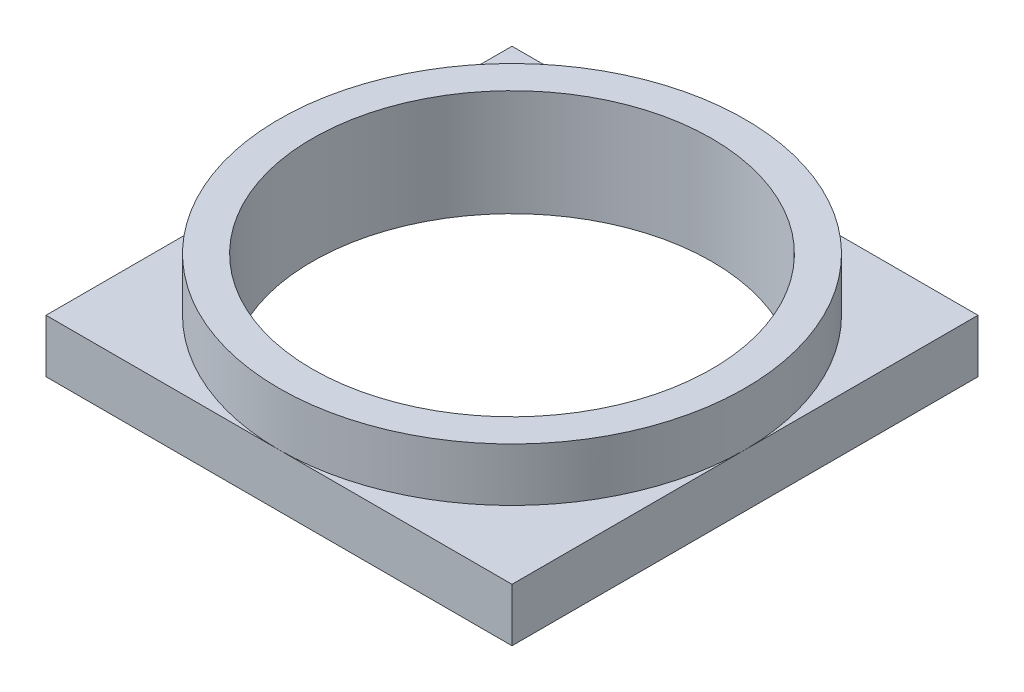
ISO-10303-21;
HEADER;
FILE_DESCRIPTION(('STEP AP214'),'2;1');
FILE_NAME('part.step','',(''),(''),'','','');
FILE_SCHEMA(('AUTOMOTIVE_DESIGN { 1 0 10303 214 1 1 1 1 }'));
ENDSEC;
DATA;
#1=APPLICATION_CONTEXT('core data for automotive mechanical design processes');
#2=APPLICATION_PROTOCOL_DEFINITION('international standard','automotive_design',2000,#1);
#3=PRODUCT_CONTEXT('',#1,'mechanical');
#4=PRODUCT('Part','Part','',(#3));
#5=PRODUCT_RELATED_PRODUCT_CATEGORY('part','',(#4));
#6=PRODUCT_DEFINITION_FORMATION('','',#4);
#7=PRODUCT_DEFINITION_CONTEXT('part definition',#1,'design');
#8=PRODUCT_DEFINITION('design','',#6,#7);
#9=PRODUCT_DEFINITION_SHAPE('','',#8);
#10=(LENGTH_UNIT() NAMED_UNIT(*) SI_UNIT(.MILLI.,.METRE.));
#11=(NAMED_UNIT(*) PLANE_ANGLE_UNIT() SI_UNIT($,.RADIAN.));
#12=(NAMED_UNIT(*) SI_UNIT($,.STERADIAN.) SOLID_ANGLE_UNIT());
#13=UNCERTAINTY_MEASURE_WITH_UNIT(LENGTH_MEASURE(1.E-05),#10,'distance_accuracy_value','');
#14=(GEOMETRIC_REPRESENTATION_CONTEXT(3) GLOBAL_UNCERTAINTY_ASSIGNED_CONTEXT((#13)) GLOBAL_UNIT_ASSIGNED_CONTEXT((#10,
#11,#12)) REPRESENTATION_CONTEXT('',''));
#15=CARTESIAN_POINT('',(0.,0.,0.));
#16=DIRECTION('',(0.,0.,1.));
#17=DIRECTION('',(1.,0.,0.));
#18=AXIS2_PLACEMENT_3D('',#15,#16,#17);
#19=CARTESIAN_POINT('',(0.,1.6,0.));
#20=DIRECTION('',(0.,-1.,0.));
#21=DIRECTION('',(0.,0.,-1.));
#22=AXIS2_PLACEMENT_3D('',#19,#20,#21);
#23=PLANE('',#22);
#24=CARTESIAN_POINT('',(0.,1.6,0.));
#25=DIRECTION('',(0.,1.,0.));
#26=DIRECTION('',(0.,0.,1.));
#27=AXIS2_PLACEMENT_3D('',#24,#25,#26);
#28=CIRCLE('',#27,7.);
#29=CARTESIAN_POINT('',(0.,1.6,7.));
#30=VERTEX_POINT('',#29);
#31=CARTESIAN_POINT('',(7.,1.6,0.));
#32=VERTEX_POINT('',#31);
#33=EDGE_CURVE('E44',#30,#32,#28,.T.);
#34=ORIENTED_EDGE('',*,*,#33,.F.);
#35=DIRECTION('',(1.,0.,0.));
#36=VECTOR('',#35,1.);
#37=CARTESIAN_POINT('',(-7.,1.6,7.));
#38=LINE('',#37,#36);
#39=CARTESIAN_POINT('',(7.,1.6,7.));
#40=VERTEX_POINT('',#39);
#41=EDGE_CURVE('E95',#30,#40,#38,.T.);
#42=ORIENTED_EDGE('',*,*,#41,.T.);
#43=DIRECTION('',(0.,0.,-1.));
#44=VECTOR('',#43,1.);
#45=CARTESIAN_POINT('',(7.,1.6,7.));
#46=LINE('',#45,#44);
#47=EDGE_CURVE('E106',#40,#32,#46,.T.);
#48=ORIENTED_EDGE('',*,*,#47,.T.);
#49=EDGE_LOOP('',(#34,#42,#48));
#50=FACE_BOUND('',#49,.T.);
#51=ADVANCED_FACE('F33',(#50),#23,.F.);
#52=CARTESIAN_POINT('',(0.,1.6,-7.));
#53=VERTEX_POINT('',#52);
#54=EDGE_CURVE('E11',#32,#53,#28,.T.);
#55=ORIENTED_EDGE('',*,*,#54,.F.);
#56=CARTESIAN_POINT('',(7.,1.6,-7.));
#57=VERTEX_POINT('',#56);
#58=EDGE_CURVE('E118',#32,#57,#46,.T.);
#59=ORIENTED_EDGE('',*,*,#58,.T.);
#60=DIRECTION('',(-1.,0.,0.));
#61=VECTOR('',#60,1.);
#62=CARTESIAN_POINT('',(-7.,1.6,-7.));
#63=LINE('',#62,#61);
#64=EDGE_CURVE('E119',#57,#53,#63,.T.);
#65=ORIENTED_EDGE('',*,*,#64,.T.);
#66=EDGE_LOOP('',(#55,#59,#65));
#67=FACE_BOUND('',#66,.T.);
#68=ADVANCED_FACE('F150',(#67),#23,.F.);
#69=CARTESIAN_POINT('',(-7.,1.6,0.));
#70=VERTEX_POINT('',#69);
#71=EDGE_CURVE('E42',#53,#70,#28,.T.);
#72=ORIENTED_EDGE('',*,*,#71,.F.);
#73=CARTESIAN_POINT('',(-7.,1.6,-7.));
#74=VERTEX_POINT('',#73);
#75=EDGE_CURVE('E117',#53,#74,#63,.T.);
#76=ORIENTED_EDGE('',*,*,#75,.T.);
#77=DIRECTION('',(0.,0.,1.));
#78=VECTOR('',#77,1.);
#79=CARTESIAN_POINT('',(-7.,1.6,7.));
#80=LINE('',#79,#78);
#81=EDGE_CURVE('E104',#74,#70,#80,.T.);
#82=ORIENTED_EDGE('',*,*,#81,.T.);
#83=EDGE_LOOP('',(#72,#76,#82));
#84=FACE_BOUND('',#83,.T.);
#85=ADVANCED_FACE('F152',(#84),#23,.F.);
#86=CARTESIAN_POINT('',(7.,1.6,7.));
#87=DIRECTION('',(-1.,0.,0.));
#88=DIRECTION('',(0.,0.,1.));
#89=AXIS2_PLACEMENT_3D('',#86,#87,#88);
#90=PLANE('',#89);
#91=DIRECTION('',(0.,0.,-1.));
#92=VECTOR('',#91,1.);
#93=CARTESIAN_POINT('',(7.,0.,7.));
#94=LINE('',#93,#92);
#95=CARTESIAN_POINT('',(7.,0.,7.));
#96=VERTEX_POINT('',#95);
#97=CARTESIAN_POINT('',(7.,0.,-7.));
#98=VERTEX_POINT('',#97);
#99=EDGE_CURVE('E123',#96,#98,#94,.T.);
#100=ORIENTED_EDGE('',*,*,#99,.T.);
#101=DIRECTION('',(0.,-1.,0.));
#102=VECTOR('',#101,1.);
#103=CARTESIAN_POINT('',(7.,1.6,-7.));
#104=LINE('',#103,#102);
#105=EDGE_CURVE('E37',#57,#98,#104,.T.);
#106=ORIENTED_EDGE('',*,*,#105,.F.);
#107=ORIENTED_EDGE('',*,*,#58,.F.);
#108=ORIENTED_EDGE('',*,*,#47,.F.);
#109=DIRECTION('',(0.,-1.,0.));
#110=VECTOR('',#109,1.);
#111=CARTESIAN_POINT('',(7.,1.6,7.));
#112=LINE('',#111,#110);
#113=EDGE_CURVE('E94',#40,#96,#112,.T.);
#114=ORIENTED_EDGE('',*,*,#113,.T.);
#115=EDGE_LOOP('',(#100,#106,#107,#108,#114));
#116=FACE_BOUND('',#115,.T.);
#117=ADVANCED_FACE('F35',(#116),#90,.F.);
#118=CARTESIAN_POINT('',(-7.,1.6,-7.));
#119=DIRECTION('',(0.,0.,1.));
#120=DIRECTION('',(1.,0.,0.));
#121=AXIS2_PLACEMENT_3D('',#118,#119,#120);
#122=PLANE('',#121);
#123=DIRECTION('',(-1.,0.,0.));
#124=VECTOR('',#123,1.);
#125=CARTESIAN_POINT('',(-7.,0.,-7.));
#126=LINE('',#125,#124);
#127=CARTESIAN_POINT('',(-7.,0.,-7.));
#128=VERTEX_POINT('',#127);
#129=EDGE_CURVE('E126',#98,#128,#126,.T.);
#130=ORIENTED_EDGE('',*,*,#129,.T.);
#131=DIRECTION('',(0.,-1.,0.));
#132=VECTOR('',#131,1.);
#133=CARTESIAN_POINT('',(-7.,1.6,-7.));
#134=LINE('',#133,#132);
#135=EDGE_CURVE('E112',#74,#128,#134,.T.);
#136=ORIENTED_EDGE('',*,*,#135,.F.);
#137=ORIENTED_EDGE('',*,*,#75,.F.);
#138=ORIENTED_EDGE('',*,*,#64,.F.);
#139=ORIENTED_EDGE('',*,*,#105,.T.);
#140=EDGE_LOOP('',(#130,#136,#137,#138,#139));
#141=FACE_BOUND('',#140,.T.);
#142=ADVANCED_FACE('F151',(#141),#122,.F.);
#143=CARTESIAN_POINT('',(-7.,1.6,7.));
#144=DIRECTION('',(1.,0.,0.));
#145=DIRECTION('',(0.,0.,-1.));
#146=AXIS2_PLACEMENT_3D('',#143,#144,#145);
#147=PLANE('',#146);
#148=DIRECTION('',(0.,0.,1.));
#149=VECTOR('',#148,1.);
#150=CARTESIAN_POINT('',(-7.,0.,7.));
#151=LINE('',#150,#149);
#152=CARTESIAN_POINT('',(-7.,0.,7.));
#153=VERTEX_POINT('',#152);
#154=EDGE_CURVE('E128',#128,#153,#151,.T.);
#155=ORIENTED_EDGE('',*,*,#154,.T.);
#156=DIRECTION('',(0.,-1.,0.));
#157=VECTOR('',#156,1.);
#158=CARTESIAN_POINT('',(-7.,1.6,7.));
#159=LINE('',#158,#157);
#160=CARTESIAN_POINT('',(-7.,1.6,7.));
#161=VERTEX_POINT('',#160);
#162=EDGE_CURVE('E133',#161,#153,#159,.T.);
#163=ORIENTED_EDGE('',*,*,#162,.F.);
#164=EDGE_CURVE('E90',#70,#161,#80,.T.);
#165=ORIENTED_EDGE('',*,*,#164,.F.);
#166=ORIENTED_EDGE('',*,*,#81,.F.);
#167=ORIENTED_EDGE('',*,*,#135,.T.);
#168=EDGE_LOOP('',(#155,#163,#165,#166,#167));
#169=FACE_BOUND('',#168,.T.);
#170=ADVANCED_FACE('F139',(#169),#147,.F.);
#171=CARTESIAN_POINT('',(-7.,1.6,7.));
#172=DIRECTION('',(0.,0.,-1.));
#173=DIRECTION('',(-1.,0.,0.));
#174=AXIS2_PLACEMENT_3D('',#171,#172,#173);
#175=PLANE('',#174);
#176=DIRECTION('',(1.,0.,0.));
#177=VECTOR('',#176,1.);
#178=CARTESIAN_POINT('',(-7.,0.,7.));
#179=LINE('',#178,#177);
#180=EDGE_CURVE('E130',#153,#96,#179,.T.);
#181=ORIENTED_EDGE('',*,*,#180,.T.);
#182=ORIENTED_EDGE('',*,*,#113,.F.);
#183=ORIENTED_EDGE('',*,*,#41,.F.);
#184=EDGE_CURVE('E87',#161,#30,#38,.T.);
#185=ORIENTED_EDGE('',*,*,#184,.F.);
#186=ORIENTED_EDGE('',*,*,#162,.T.);
#187=EDGE_LOOP('',(#181,#182,#183,#185,#186));
#188=FACE_BOUND('',#187,.T.);
#189=ADVANCED_FACE('F99',(#188),#175,.F.);
#190=EDGE_CURVE('E51',#70,#30,#28,.T.);
#191=ORIENTED_EDGE('',*,*,#190,.F.);
#192=ORIENTED_EDGE('',*,*,#164,.T.);
#193=ORIENTED_EDGE('',*,*,#184,.T.);
#194=EDGE_LOOP('',(#191,#192,#193));
#195=FACE_BOUND('',#194,.T.);
#196=ADVANCED_FACE('F89',(#195),#23,.F.);
#197=CARTESIAN_POINT('',(0.,0.,0.));
#198=DIRECTION('',(0.,-1.,0.));
#199=DIRECTION('',(0.,0.,-1.));
#200=AXIS2_PLACEMENT_3D('',#197,#198,#199);
#201=PLANE('',#200);
#202=CARTESIAN_POINT('',(0.,0.,0.));
#203=DIRECTION('',(0.,1.,0.));
#204=DIRECTION('',(0.,0.,1.));
#205=AXIS2_PLACEMENT_3D('',#202,#203,#204);
#206=CIRCLE('',#205,6.);
#207=CARTESIAN_POINT('',(0.,0.,6.));
#208=VERTEX_POINT('',#207);
#209=EDGE_CURVE('E256',#208,#208,#206,.T.);
#210=ORIENTED_EDGE('',*,*,#209,.T.);
#211=EDGE_LOOP('',(#210));
#212=FACE_BOUND('',#211,.T.);
#213=ORIENTED_EDGE('',*,*,#99,.F.);
#214=ORIENTED_EDGE('',*,*,#180,.F.);
#215=ORIENTED_EDGE('',*,*,#154,.F.);
#216=ORIENTED_EDGE('',*,*,#129,.F.);
#217=EDGE_LOOP('',(#213,#214,#215,#216));
#218=FACE_BOUND('',#217,.T.);
#219=ADVANCED_FACE('F144',(#212,#218),#201,.T.);
#220=CARTESIAN_POINT('',(0.,3.2,0.));
#221=DIRECTION('',(0.,1.,0.));
#222=DIRECTION('',(0.,0.,1.));
#223=AXIS2_PLACEMENT_3D('',#220,#221,#222);
#224=PLANE('',#223);
#225=CARTESIAN_POINT('',(0.,3.2,0.));
#226=DIRECTION('',(0.,1.,0.));
#227=DIRECTION('',(0.,0.,1.));
#228=AXIS2_PLACEMENT_3D('',#225,#226,#227);
#229=CIRCLE('',#228,7.);
#230=CARTESIAN_POINT('',(0.,3.2,7.));
#231=VERTEX_POINT('',#230);
#232=EDGE_CURVE('E108',#231,#231,#229,.T.);
#233=ORIENTED_EDGE('',*,*,#232,.T.);
#234=EDGE_LOOP('',(#233));
#235=FACE_BOUND('',#234,.T.);
#236=CARTESIAN_POINT('',(0.,3.2,0.));
#237=DIRECTION('',(0.,1.,0.));
#238=DIRECTION('',(0.,0.,1.));
#239=AXIS2_PLACEMENT_3D('',#236,#237,#238);
#240=CIRCLE('',#239,6.);
#241=CARTESIAN_POINT('',(0.,3.2,6.));
#242=VERTEX_POINT('',#241);
#243=EDGE_CURVE('E109',#242,#242,#240,.T.);
#244=ORIENTED_EDGE('',*,*,#243,.F.);
#245=EDGE_LOOP('',(#244));
#246=FACE_BOUND('',#245,.T.);
#247=ADVANCED_FACE('F215',(#235,#246),#224,.T.);
#248=CARTESIAN_POINT('',(0.,3.2,0.));
#249=DIRECTION('',(0.,-1.,0.));
#250=DIRECTION('',(0.,0.,-1.));
#251=AXIS2_PLACEMENT_3D('',#248,#249,#250);
#252=CYLINDRICAL_SURFACE('',#251,7.);
#253=ORIENTED_EDGE('',*,*,#232,.F.);
#254=EDGE_LOOP('',(#253));
#255=FACE_BOUND('',#254,.T.);
#256=ORIENTED_EDGE('',*,*,#33,.T.);
#257=ORIENTED_EDGE('',*,*,#54,.T.);
#258=ORIENTED_EDGE('',*,*,#71,.T.);
#259=ORIENTED_EDGE('',*,*,#190,.T.);
#260=EDGE_LOOP('',(#256,#257,#258,#259));
#261=FACE_BOUND('',#260,.T.);
#262=ADVANCED_FACE('F110',(#255,#261),#252,.T.);
#263=CARTESIAN_POINT('',(0.,3.2,0.));
#264=DIRECTION('',(0.,-1.,0.));
#265=DIRECTION('',(0.,0.,-1.));
#266=AXIS2_PLACEMENT_3D('',#263,#264,#265);
#267=CYLINDRICAL_SURFACE('',#266,6.);
#268=ORIENTED_EDGE('',*,*,#243,.T.);
#269=EDGE_LOOP('',(#268));
#270=FACE_BOUND('',#269,.T.);
#271=ORIENTED_EDGE('',*,*,#209,.F.);
#272=EDGE_LOOP('',(#271));
#273=FACE_BOUND('',#272,.T.);
#274=ADVANCED_FACE('F229',(#270,#273),#267,.F.);
#275=CLOSED_SHELL('',(#51,#68,#85,#117,#142,#170,#189,#196,#219,#247,#262,#274));
#276=MANIFOLD_SOLID_BREP('B2',#275);
#277=ADVANCED_BREP_SHAPE_REPRESENTATION('',(#18,#276),#14);
#278=SHAPE_DEFINITION_REPRESENTATION(#9,#277);
ENDSEC;
END-ISO-10303-21;
